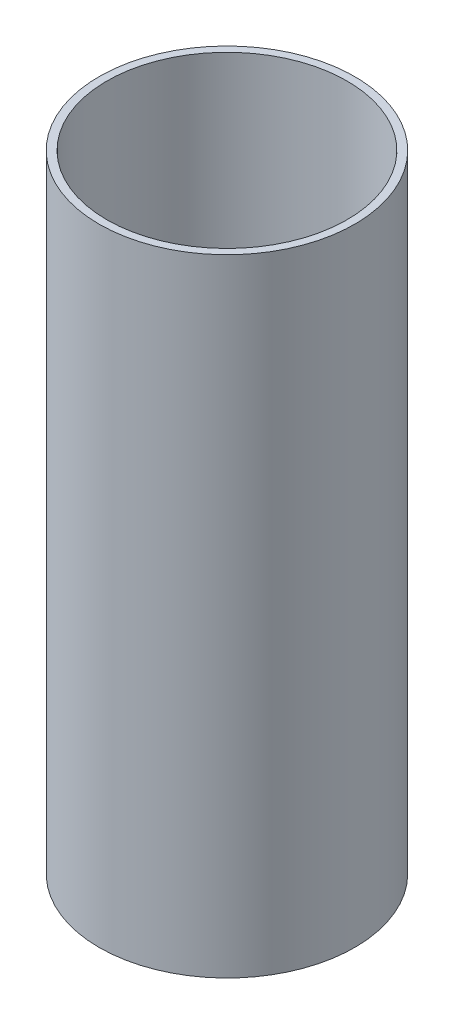
ISO-10303-21;
HEADER;
FILE_DESCRIPTION(('STEP AP214'),'2;1');
FILE_NAME('part.step','',(''),(''),'','','');
FILE_SCHEMA(('AUTOMOTIVE_DESIGN { 1 0 10303 214 1 1 1 1 }'));
ENDSEC;
DATA;
#1=APPLICATION_CONTEXT('core data for automotive mechanical design processes');
#2=APPLICATION_PROTOCOL_DEFINITION('international standard','automotive_design',2000,#1);
#3=PRODUCT_CONTEXT('',#1,'mechanical');
#4=PRODUCT('Part','Part','',(#3));
#5=PRODUCT_RELATED_PRODUCT_CATEGORY('part','',(#4));
#6=PRODUCT_DEFINITION_FORMATION('','',#4);
#7=PRODUCT_DEFINITION_CONTEXT('part definition',#1,'design');
#8=PRODUCT_DEFINITION('design','',#6,#7);
#9=PRODUCT_DEFINITION_SHAPE('','',#8);
#10=(LENGTH_UNIT() NAMED_UNIT(*) SI_UNIT(.MILLI.,.METRE.));
#11=(NAMED_UNIT(*) PLANE_ANGLE_UNIT() SI_UNIT($,.RADIAN.));
#12=(NAMED_UNIT(*) SI_UNIT($,.STERADIAN.) SOLID_ANGLE_UNIT());
#13=UNCERTAINTY_MEASURE_WITH_UNIT(LENGTH_MEASURE(1.E-05),#10,'distance_accuracy_value','');
#14=(GEOMETRIC_REPRESENTATION_CONTEXT(3) GLOBAL_UNCERTAINTY_ASSIGNED_CONTEXT((#13)) GLOBAL_UNIT_ASSIGNED_CONTEXT((#10,
#11,#12)) REPRESENTATION_CONTEXT('',''));
#15=CARTESIAN_POINT('',(0.,0.,0.));
#16=DIRECTION('',(0.,0.,1.));
#17=DIRECTION('',(1.,0.,0.));
#18=AXIS2_PLACEMENT_3D('',#15,#16,#17);
#19=CARTESIAN_POINT('',(0.,245.,0.));
#20=DIRECTION('',(0.,1.,0.));
#21=DIRECTION('',(0.,0.,1.));
#22=AXIS2_PLACEMENT_3D('',#19,#20,#21);
#23=PLANE('',#22);
#24=CARTESIAN_POINT('',(0.,245.,0.));
#25=DIRECTION('',(0.,1.,0.));
#26=DIRECTION('',(0.,0.,1.));
#27=AXIS2_PLACEMENT_3D('',#24,#25,#26);
#28=CIRCLE('',#27,50.);
#29=CARTESIAN_POINT('',(0.,245.,50.));
#30=VERTEX_POINT('',#29);
#31=EDGE_CURVE('E10',#30,#30,#28,.T.);
#32=ORIENTED_EDGE('',*,*,#31,.T.);
#33=EDGE_LOOP('',(#32));
#34=FACE_BOUND('',#33,.T.);
#35=CARTESIAN_POINT('',(0.,245.,0.));
#36=DIRECTION('',(0.,1.,0.));
#37=DIRECTION('',(0.,0.,1.));
#38=AXIS2_PLACEMENT_3D('',#35,#36,#37);
#39=CIRCLE('',#38,47.);
#40=CARTESIAN_POINT('',(0.,245.,47.));
#41=VERTEX_POINT('',#40);
#42=EDGE_CURVE('E46',#41,#41,#39,.T.);
#43=ORIENTED_EDGE('',*,*,#42,.F.);
#44=EDGE_LOOP('',(#43));
#45=FACE_BOUND('',#44,.T.);
#46=ADVANCED_FACE('F35',(#34,#45),#23,.T.);
#47=CARTESIAN_POINT('',(0.,0.,0.));
#48=DIRECTION('',(0.,1.,0.));
#49=DIRECTION('',(0.,0.,1.));
#50=AXIS2_PLACEMENT_3D('',#47,#48,#49);
#51=PLANE('',#50);
#52=CARTESIAN_POINT('',(0.,0.,0.));
#53=DIRECTION('',(0.,1.,0.));
#54=DIRECTION('',(0.,0.,1.));
#55=AXIS2_PLACEMENT_3D('',#52,#53,#54);
#56=CIRCLE('',#55,50.);
#57=CARTESIAN_POINT('',(0.,0.,50.));
#58=VERTEX_POINT('',#57);
#59=EDGE_CURVE('E39',#58,#58,#56,.T.);
#60=ORIENTED_EDGE('',*,*,#59,.F.);
#61=EDGE_LOOP('',(#60));
#62=FACE_BOUND('',#61,.T.);
#63=CARTESIAN_POINT('',(0.,0.,0.));
#64=DIRECTION('',(0.,1.,0.));
#65=DIRECTION('',(0.,0.,1.));
#66=AXIS2_PLACEMENT_3D('',#63,#64,#65);
#67=CIRCLE('',#66,47.);
#68=CARTESIAN_POINT('',(0.,0.,47.));
#69=VERTEX_POINT('',#68);
#70=EDGE_CURVE('E48',#69,#69,#67,.T.);
#71=ORIENTED_EDGE('',*,*,#70,.T.);
#72=EDGE_LOOP('',(#71));
#73=FACE_BOUND('',#72,.T.);
#74=ADVANCED_FACE('F58',(#62,#73),#51,.F.);
#75=CARTESIAN_POINT('',(0.,245.,0.));
#76=DIRECTION('',(0.,-1.,0.));
#77=DIRECTION('',(0.,0.,-1.));
#78=AXIS2_PLACEMENT_3D('',#75,#76,#77);
#79=CYLINDRICAL_SURFACE('',#78,50.);
#80=ORIENTED_EDGE('',*,*,#31,.F.);
#81=EDGE_LOOP('',(#80));
#82=FACE_BOUND('',#81,.T.);
#83=ORIENTED_EDGE('',*,*,#59,.T.);
#84=EDGE_LOOP('',(#83));
#85=FACE_BOUND('',#84,.T.);
#86=ADVANCED_FACE('F37',(#82,#85),#79,.T.);
#87=CARTESIAN_POINT('',(0.,245.,0.));
#88=DIRECTION('',(0.,-1.,0.));
#89=DIRECTION('',(0.,0.,-1.));
#90=AXIS2_PLACEMENT_3D('',#87,#88,#89);
#91=CYLINDRICAL_SURFACE('',#90,47.);
#92=ORIENTED_EDGE('',*,*,#42,.T.);
#93=EDGE_LOOP('',(#92));
#94=FACE_BOUND('',#93,.T.);
#95=ORIENTED_EDGE('',*,*,#70,.F.);
#96=EDGE_LOOP('',(#95));
#97=FACE_BOUND('',#96,.T.);
#98=ADVANCED_FACE('F54',(#94,#97),#91,.F.);
#99=CLOSED_SHELL('',(#46,#74,#86,#98));
#100=MANIFOLD_SOLID_BREP('B2',#99);
#101=ADVANCED_BREP_SHAPE_REPRESENTATION('',(#18,#100),#14);
#102=SHAPE_DEFINITION_REPRESENTATION(#9,#101);
ENDSEC;
END-ISO-10303-21;
